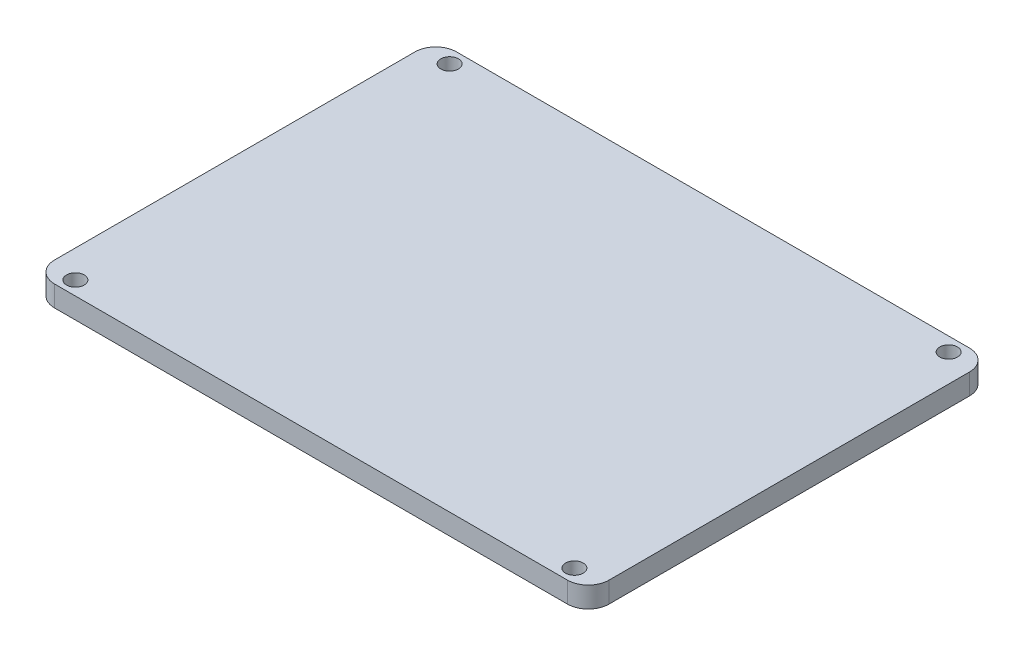
ISO-10303-21;
HEADER;
FILE_DESCRIPTION(('STEP AP214'),'2;1');
FILE_NAME('part.step','',(''),(''),'','','');
FILE_SCHEMA(('AUTOMOTIVE_DESIGN { 1 0 10303 214 1 1 1 1 }'));
ENDSEC;
DATA;
#1=APPLICATION_CONTEXT('core data for automotive mechanical design processes');
#2=APPLICATION_PROTOCOL_DEFINITION('international standard','automotive_design',2000,#1);
#3=PRODUCT_CONTEXT('',#1,'mechanical');
#4=PRODUCT('Part','Part','',(#3));
#5=PRODUCT_RELATED_PRODUCT_CATEGORY('part','',(#4));
#6=PRODUCT_DEFINITION_FORMATION('','',#4);
#7=PRODUCT_DEFINITION_CONTEXT('part definition',#1,'design');
#8=PRODUCT_DEFINITION('design','',#6,#7);
#9=PRODUCT_DEFINITION_SHAPE('','',#8);
#10=(LENGTH_UNIT() NAMED_UNIT(*) SI_UNIT(.MILLI.,.METRE.));
#11=(NAMED_UNIT(*) PLANE_ANGLE_UNIT() SI_UNIT($,.RADIAN.));
#12=(NAMED_UNIT(*) SI_UNIT($,.STERADIAN.) SOLID_ANGLE_UNIT());
#13=UNCERTAINTY_MEASURE_WITH_UNIT(LENGTH_MEASURE(1.E-05),#10,'distance_accuracy_value','');
#14=(GEOMETRIC_REPRESENTATION_CONTEXT(3) GLOBAL_UNCERTAINTY_ASSIGNED_CONTEXT((#13)) GLOBAL_UNIT_ASSIGNED_CONTEXT((#10,
#11,#12)) REPRESENTATION_CONTEXT('',''));
#15=CARTESIAN_POINT('',(0.,0.,0.));
#16=DIRECTION('',(0.,0.,1.));
#17=DIRECTION('',(1.,0.,0.));
#18=AXIS2_PLACEMENT_3D('',#15,#16,#17);
#19=CARTESIAN_POINT('',(40.,3.,29.));
#20=DIRECTION('',(-1.,0.,0.));
#21=DIRECTION('',(0.,0.,1.));
#22=AXIS2_PLACEMENT_3D('',#19,#20,#21);
#23=PLANE('',#22);
#24=DIRECTION('',(0.,0.,-1.));
#25=VECTOR('',#24,1.);
#26=CARTESIAN_POINT('',(40.,3.,29.));
#27=LINE('',#26,#25);
#28=CARTESIAN_POINT('',(40.,3.,26.));
#29=VERTEX_POINT('',#28);
#30=CARTESIAN_POINT('',(40.,3.,-26.));
#31=VERTEX_POINT('',#30);
#32=EDGE_CURVE('E121',#29,#31,#27,.T.);
#33=ORIENTED_EDGE('',*,*,#32,.F.);
#34=DIRECTION('',(0.,-1.,0.));
#35=VECTOR('',#34,1.);
#36=CARTESIAN_POINT('',(40.,3.,26.));
#37=LINE('',#36,#35);
#38=CARTESIAN_POINT('',(40.,0.,26.));
#39=VERTEX_POINT('',#38);
#40=EDGE_CURVE('E106',#29,#39,#37,.T.);
#41=ORIENTED_EDGE('',*,*,#40,.T.);
#42=DIRECTION('',(0.,0.,-1.));
#43=VECTOR('',#42,1.);
#44=CARTESIAN_POINT('',(40.,0.,29.));
#45=LINE('',#44,#43);
#46=CARTESIAN_POINT('',(40.,0.,-26.));
#47=VERTEX_POINT('',#46);
#48=EDGE_CURVE('E118',#39,#47,#45,.T.);
#49=ORIENTED_EDGE('',*,*,#48,.T.);
#50=DIRECTION('',(0.,-1.,0.));
#51=VECTOR('',#50,1.);
#52=CARTESIAN_POINT('',(40.,3.,-26.));
#53=LINE('',#52,#51);
#54=EDGE_CURVE('E123',#47,#31,#53,.F.);
#55=ORIENTED_EDGE('',*,*,#54,.T.);
#56=EDGE_LOOP('',(#33,#41,#49,#55));
#57=FACE_BOUND('',#56,.T.);
#58=ADVANCED_FACE('F35',(#57),#23,.F.);
#59=CARTESIAN_POINT('',(-40.,3.,-29.));
#60=DIRECTION('',(0.,0.,1.));
#61=DIRECTION('',(1.,0.,0.));
#62=AXIS2_PLACEMENT_3D('',#59,#60,#61);
#63=PLANE('',#62);
#64=DIRECTION('',(-1.,0.,0.));
#65=VECTOR('',#64,1.);
#66=CARTESIAN_POINT('',(-40.,3.,-29.));
#67=LINE('',#66,#65);
#68=CARTESIAN_POINT('',(37.,3.,-29.));
#69=VERTEX_POINT('',#68);
#70=CARTESIAN_POINT('',(-37.,3.,-29.));
#71=VERTEX_POINT('',#70);
#72=EDGE_CURVE('E165',#69,#71,#67,.T.);
#73=ORIENTED_EDGE('',*,*,#72,.F.);
#74=DIRECTION('',(0.,-1.,0.));
#75=VECTOR('',#74,1.);
#76=CARTESIAN_POINT('',(37.,3.,-29.));
#77=LINE('',#76,#75);
#78=CARTESIAN_POINT('',(37.,0.,-29.));
#79=VERTEX_POINT('',#78);
#80=EDGE_CURVE('E11',#69,#79,#77,.T.);
#81=ORIENTED_EDGE('',*,*,#80,.T.);
#82=DIRECTION('',(-1.,0.,0.));
#83=VECTOR('',#82,1.);
#84=CARTESIAN_POINT('',(-40.,0.,-29.));
#85=LINE('',#84,#83);
#86=CARTESIAN_POINT('',(-37.,0.,-29.));
#87=VERTEX_POINT('',#86);
#88=EDGE_CURVE('E128',#79,#87,#85,.T.);
#89=ORIENTED_EDGE('',*,*,#88,.T.);
#90=DIRECTION('',(0.,-1.,0.));
#91=VECTOR('',#90,1.);
#92=CARTESIAN_POINT('',(-37.,3.,-29.));
#93=LINE('',#92,#91);
#94=EDGE_CURVE('E43',#87,#71,#93,.F.);
#95=ORIENTED_EDGE('',*,*,#94,.T.);
#96=EDGE_LOOP('',(#73,#81,#89,#95));
#97=FACE_BOUND('',#96,.T.);
#98=ADVANCED_FACE('F164',(#97),#63,.F.);
#99=CARTESIAN_POINT('',(-40.,3.,29.));
#100=DIRECTION('',(1.,0.,0.));
#101=DIRECTION('',(0.,0.,-1.));
#102=AXIS2_PLACEMENT_3D('',#99,#100,#101);
#103=PLANE('',#102);
#104=DIRECTION('',(0.,0.,1.));
#105=VECTOR('',#104,1.);
#106=CARTESIAN_POINT('',(-40.,0.,29.));
#107=LINE('',#106,#105);
#108=CARTESIAN_POINT('',(-40.,0.,-26.));
#109=VERTEX_POINT('',#108);
#110=CARTESIAN_POINT('',(-40.,0.,26.));
#111=VERTEX_POINT('',#110);
#112=EDGE_CURVE('E132',#109,#111,#107,.T.);
#113=ORIENTED_EDGE('',*,*,#112,.T.);
#114=DIRECTION('',(0.,-1.,0.));
#115=VECTOR('',#114,1.);
#116=CARTESIAN_POINT('',(-40.,3.,26.));
#117=LINE('',#116,#115);
#118=CARTESIAN_POINT('',(-40.,3.,26.));
#119=VERTEX_POINT('',#118);
#120=EDGE_CURVE('E50',#111,#119,#117,.F.);
#121=ORIENTED_EDGE('',*,*,#120,.T.);
#122=DIRECTION('',(0.,0.,1.));
#123=VECTOR('',#122,1.);
#124=CARTESIAN_POINT('',(-40.,3.,29.));
#125=LINE('',#124,#123);
#126=CARTESIAN_POINT('',(-40.,3.,-26.));
#127=VERTEX_POINT('',#126);
#128=EDGE_CURVE('E171',#127,#119,#125,.T.);
#129=ORIENTED_EDGE('',*,*,#128,.F.);
#130=DIRECTION('',(0.,-1.,0.));
#131=VECTOR('',#130,1.);
#132=CARTESIAN_POINT('',(-40.,3.,-26.));
#133=LINE('',#132,#131);
#134=EDGE_CURVE('E158',#127,#109,#133,.T.);
#135=ORIENTED_EDGE('',*,*,#134,.T.);
#136=EDGE_LOOP('',(#113,#121,#129,#135));
#137=FACE_BOUND('',#136,.T.);
#138=ADVANCED_FACE('F175',(#137),#103,.F.);
#139=CARTESIAN_POINT('',(-40.,3.,29.));
#140=DIRECTION('',(0.,0.,-1.));
#141=DIRECTION('',(-1.,0.,0.));
#142=AXIS2_PLACEMENT_3D('',#139,#140,#141);
#143=PLANE('',#142);
#144=DIRECTION('',(1.,0.,0.));
#145=VECTOR('',#144,1.);
#146=CARTESIAN_POINT('',(-40.,0.,29.));
#147=LINE('',#146,#145);
#148=CARTESIAN_POINT('',(-37.,0.,29.));
#149=VERTEX_POINT('',#148);
#150=CARTESIAN_POINT('',(37.,0.,29.));
#151=VERTEX_POINT('',#150);
#152=EDGE_CURVE('E142',#149,#151,#147,.T.);
#153=ORIENTED_EDGE('',*,*,#152,.T.);
#154=DIRECTION('',(0.,-1.,0.));
#155=VECTOR('',#154,1.);
#156=CARTESIAN_POINT('',(37.,3.,29.));
#157=LINE('',#156,#155);
#158=CARTESIAN_POINT('',(37.,3.,29.));
#159=VERTEX_POINT('',#158);
#160=EDGE_CURVE('E107',#151,#159,#157,.F.);
#161=ORIENTED_EDGE('',*,*,#160,.T.);
#162=DIRECTION('',(1.,0.,0.));
#163=VECTOR('',#162,1.);
#164=CARTESIAN_POINT('',(-40.,3.,29.));
#165=LINE('',#164,#163);
#166=CARTESIAN_POINT('',(-37.,3.,29.));
#167=VERTEX_POINT('',#166);
#168=EDGE_CURVE('E138',#167,#159,#165,.T.);
#169=ORIENTED_EDGE('',*,*,#168,.F.);
#170=DIRECTION('',(0.,-1.,0.));
#171=VECTOR('',#170,1.);
#172=CARTESIAN_POINT('',(-37.,3.,29.));
#173=LINE('',#172,#171);
#174=EDGE_CURVE('E112',#167,#149,#173,.T.);
#175=ORIENTED_EDGE('',*,*,#174,.T.);
#176=EDGE_LOOP('',(#153,#161,#169,#175));
#177=FACE_BOUND('',#176,.T.);
#178=ADVANCED_FACE('F182',(#177),#143,.F.);
#179=CARTESIAN_POINT('',(0.,3.,0.));
#180=DIRECTION('',(0.,-1.,0.));
#181=DIRECTION('',(0.,0.,-1.));
#182=AXIS2_PLACEMENT_3D('',#179,#180,#181);
#183=PLANE('',#182);
#184=CARTESIAN_POINT('',(-36.,3.,27.));
#185=DIRECTION('',(0.,-1.,0.));
#186=DIRECTION('',(0.,0.,-1.));
#187=AXIS2_PLACEMENT_3D('',#184,#185,#186);
#188=CIRCLE('',#187,1.275);
#189=CARTESIAN_POINT('',(-36.,3.,25.725));
#190=VERTEX_POINT('',#189);
#191=EDGE_CURVE('E129',#190,#190,#188,.T.);
#192=ORIENTED_EDGE('',*,*,#191,.T.);
#193=EDGE_LOOP('',(#192));
#194=FACE_BOUND('',#193,.T.);
#195=CARTESIAN_POINT('',(-36.,3.,-27.));
#196=DIRECTION('',(0.,-1.,0.));
#197=DIRECTION('',(0.,0.,-1.));
#198=AXIS2_PLACEMENT_3D('',#195,#196,#197);
#199=CIRCLE('',#198,1.275);
#200=CARTESIAN_POINT('',(-36.,3.,-28.275));
#201=VERTEX_POINT('',#200);
#202=EDGE_CURVE('E135',#201,#201,#199,.T.);
#203=ORIENTED_EDGE('',*,*,#202,.T.);
#204=EDGE_LOOP('',(#203));
#205=FACE_BOUND('',#204,.T.);
#206=CARTESIAN_POINT('',(36.,3.,-27.));
#207=DIRECTION('',(0.,-1.,0.));
#208=DIRECTION('',(0.,0.,-1.));
#209=AXIS2_PLACEMENT_3D('',#206,#207,#208);
#210=CIRCLE('',#209,1.275);
#211=CARTESIAN_POINT('',(36.,3.,-28.275));
#212=VERTEX_POINT('',#211);
#213=EDGE_CURVE('E187',#212,#212,#210,.T.);
#214=ORIENTED_EDGE('',*,*,#213,.T.);
#215=EDGE_LOOP('',(#214));
#216=FACE_BOUND('',#215,.T.);
#217=CARTESIAN_POINT('',(36.,3.,27.));
#218=DIRECTION('',(0.,-1.,0.));
#219=DIRECTION('',(0.,0.,-1.));
#220=AXIS2_PLACEMENT_3D('',#217,#218,#219);
#221=CIRCLE('',#220,1.275);
#222=CARTESIAN_POINT('',(36.,3.,25.725));
#223=VERTEX_POINT('',#222);
#224=EDGE_CURVE('E190',#223,#223,#221,.T.);
#225=ORIENTED_EDGE('',*,*,#224,.T.);
#226=EDGE_LOOP('',(#225));
#227=FACE_BOUND('',#226,.T.);
#228=ORIENTED_EDGE('',*,*,#168,.T.);
#229=CARTESIAN_POINT('',(37.,3.,26.));
#230=DIRECTION('',(0.,-1.,0.));
#231=DIRECTION('',(0.,0.,-1.));
#232=AXIS2_PLACEMENT_3D('',#229,#230,#231);
#233=CIRCLE('',#232,3.);
#234=EDGE_CURVE('E156',#159,#29,#233,.F.);
#235=ORIENTED_EDGE('',*,*,#234,.T.);
#236=ORIENTED_EDGE('',*,*,#32,.T.);
#237=CARTESIAN_POINT('',(37.,3.,-26.));
#238=DIRECTION('',(0.,-1.,0.));
#239=DIRECTION('',(0.,0.,-1.));
#240=AXIS2_PLACEMENT_3D('',#237,#238,#239);
#241=CIRCLE('',#240,3.);
#242=EDGE_CURVE('E152',#31,#69,#241,.F.);
#243=ORIENTED_EDGE('',*,*,#242,.T.);
#244=ORIENTED_EDGE('',*,*,#72,.T.);
#245=CARTESIAN_POINT('',(-37.,3.,-26.));
#246=DIRECTION('',(0.,-1.,0.));
#247=DIRECTION('',(0.,0.,-1.));
#248=AXIS2_PLACEMENT_3D('',#245,#246,#247);
#249=CIRCLE('',#248,3.);
#250=EDGE_CURVE('E57',#71,#127,#249,.F.);
#251=ORIENTED_EDGE('',*,*,#250,.T.);
#252=ORIENTED_EDGE('',*,*,#128,.T.);
#253=CARTESIAN_POINT('',(-37.,3.,26.));
#254=DIRECTION('',(0.,-1.,0.));
#255=DIRECTION('',(0.,0.,-1.));
#256=AXIS2_PLACEMENT_3D('',#253,#254,#255);
#257=CIRCLE('',#256,3.);
#258=EDGE_CURVE('E154',#119,#167,#257,.F.);
#259=ORIENTED_EDGE('',*,*,#258,.T.);
#260=EDGE_LOOP('',(#228,#235,#236,#243,#244,#251,#252,#259));
#261=FACE_BOUND('',#260,.T.);
#262=ADVANCED_FACE('F169',(#194,#205,#216,#227,#261),#183,.F.);
#263=CARTESIAN_POINT('',(0.,0.,0.));
#264=DIRECTION('',(0.,-1.,0.));
#265=DIRECTION('',(0.,0.,-1.));
#266=AXIS2_PLACEMENT_3D('',#263,#264,#265);
#267=PLANE('',#266);
#268=CARTESIAN_POINT('',(-36.,0.,27.));
#269=DIRECTION('',(0.,1.,0.));
#270=DIRECTION('',(0.,0.,1.));
#271=AXIS2_PLACEMENT_3D('',#268,#269,#270);
#272=CIRCLE('',#271,1.275);
#273=CARTESIAN_POINT('',(-36.,0.,28.275));
#274=VERTEX_POINT('',#273);
#275=EDGE_CURVE('E197',#274,#274,#272,.T.);
#276=ORIENTED_EDGE('',*,*,#275,.T.);
#277=EDGE_LOOP('',(#276));
#278=FACE_BOUND('',#277,.T.);
#279=CARTESIAN_POINT('',(-36.,0.,-27.));
#280=DIRECTION('',(0.,1.,0.));
#281=DIRECTION('',(0.,0.,1.));
#282=AXIS2_PLACEMENT_3D('',#279,#280,#281);
#283=CIRCLE('',#282,1.275);
#284=CARTESIAN_POINT('',(-36.,0.,-25.725));
#285=VERTEX_POINT('',#284);
#286=EDGE_CURVE('E200',#285,#285,#283,.T.);
#287=ORIENTED_EDGE('',*,*,#286,.T.);
#288=EDGE_LOOP('',(#287));
#289=FACE_BOUND('',#288,.T.);
#290=CARTESIAN_POINT('',(36.,0.,-27.));
#291=DIRECTION('',(0.,1.,0.));
#292=DIRECTION('',(0.,0.,1.));
#293=AXIS2_PLACEMENT_3D('',#290,#291,#292);
#294=CIRCLE('',#293,1.275);
#295=CARTESIAN_POINT('',(36.,0.,-25.725));
#296=VERTEX_POINT('',#295);
#297=EDGE_CURVE('E196',#296,#296,#294,.T.);
#298=ORIENTED_EDGE('',*,*,#297,.T.);
#299=EDGE_LOOP('',(#298));
#300=FACE_BOUND('',#299,.T.);
#301=CARTESIAN_POINT('',(36.,0.,27.));
#302=DIRECTION('',(0.,1.,0.));
#303=DIRECTION('',(0.,0.,1.));
#304=AXIS2_PLACEMENT_3D('',#301,#302,#303);
#305=CIRCLE('',#304,1.275);
#306=CARTESIAN_POINT('',(36.,0.,28.275));
#307=VERTEX_POINT('',#306);
#308=EDGE_CURVE('E193',#307,#307,#305,.T.);
#309=ORIENTED_EDGE('',*,*,#308,.T.);
#310=EDGE_LOOP('',(#309));
#311=FACE_BOUND('',#310,.T.);
#312=ORIENTED_EDGE('',*,*,#48,.F.);
#313=CARTESIAN_POINT('',(37.,0.,26.));
#314=DIRECTION('',(0.,-1.,0.));
#315=DIRECTION('',(0.,0.,-1.));
#316=AXIS2_PLACEMENT_3D('',#313,#314,#315);
#317=CIRCLE('',#316,3.);
#318=EDGE_CURVE('E102',#39,#151,#317,.T.);
#319=ORIENTED_EDGE('',*,*,#318,.T.);
#320=ORIENTED_EDGE('',*,*,#152,.F.);
#321=CARTESIAN_POINT('',(-37.,0.,26.));
#322=DIRECTION('',(0.,-1.,0.));
#323=DIRECTION('',(0.,0.,-1.));
#324=AXIS2_PLACEMENT_3D('',#321,#322,#323);
#325=CIRCLE('',#324,3.);
#326=EDGE_CURVE('E113',#149,#111,#325,.T.);
#327=ORIENTED_EDGE('',*,*,#326,.T.);
#328=ORIENTED_EDGE('',*,*,#112,.F.);
#329=CARTESIAN_POINT('',(-37.,0.,-26.));
#330=DIRECTION('',(0.,-1.,0.));
#331=DIRECTION('',(0.,0.,-1.));
#332=AXIS2_PLACEMENT_3D('',#329,#330,#331);
#333=CIRCLE('',#332,3.);
#334=EDGE_CURVE('E122',#109,#87,#333,.T.);
#335=ORIENTED_EDGE('',*,*,#334,.T.);
#336=ORIENTED_EDGE('',*,*,#88,.F.);
#337=CARTESIAN_POINT('',(37.,0.,-26.));
#338=DIRECTION('',(0.,-1.,0.));
#339=DIRECTION('',(0.,0.,-1.));
#340=AXIS2_PLACEMENT_3D('',#337,#338,#339);
#341=CIRCLE('',#340,3.);
#342=EDGE_CURVE('E127',#79,#47,#341,.T.);
#343=ORIENTED_EDGE('',*,*,#342,.T.);
#344=EDGE_LOOP('',(#312,#319,#320,#327,#328,#335,#336,#343));
#345=FACE_BOUND('',#344,.T.);
#346=ADVANCED_FACE('F125',(#278,#289,#300,#311,#345),#267,.T.);
#347=CARTESIAN_POINT('',(36.,0.,27.));
#348=DIRECTION('',(0.,1.,0.));
#349=DIRECTION('',(0.,0.,1.));
#350=AXIS2_PLACEMENT_3D('',#347,#348,#349);
#351=CYLINDRICAL_SURFACE('',#350,1.275);
#352=ORIENTED_EDGE('',*,*,#308,.F.);
#353=EDGE_LOOP('',(#352));
#354=FACE_BOUND('',#353,.T.);
#355=ORIENTED_EDGE('',*,*,#224,.F.);
#356=EDGE_LOOP('',(#355));
#357=FACE_BOUND('',#356,.T.);
#358=ADVANCED_FACE('F212',(#354,#357),#351,.F.);
#359=CARTESIAN_POINT('',(36.,0.,-27.));
#360=DIRECTION('',(0.,1.,0.));
#361=DIRECTION('',(0.,0.,1.));
#362=AXIS2_PLACEMENT_3D('',#359,#360,#361);
#363=CYLINDRICAL_SURFACE('',#362,1.275);
#364=ORIENTED_EDGE('',*,*,#297,.F.);
#365=EDGE_LOOP('',(#364));
#366=FACE_BOUND('',#365,.T.);
#367=ORIENTED_EDGE('',*,*,#213,.F.);
#368=EDGE_LOOP('',(#367));
#369=FACE_BOUND('',#368,.T.);
#370=ADVANCED_FACE('F208',(#366,#369),#363,.F.);
#371=CARTESIAN_POINT('',(-36.,0.,-27.));
#372=DIRECTION('',(0.,1.,0.));
#373=DIRECTION('',(0.,0.,1.));
#374=AXIS2_PLACEMENT_3D('',#371,#372,#373);
#375=CYLINDRICAL_SURFACE('',#374,1.275);
#376=ORIENTED_EDGE('',*,*,#286,.F.);
#377=EDGE_LOOP('',(#376));
#378=FACE_BOUND('',#377,.T.);
#379=ORIENTED_EDGE('',*,*,#202,.F.);
#380=EDGE_LOOP('',(#379));
#381=FACE_BOUND('',#380,.T.);
#382=ADVANCED_FACE('F211',(#378,#381),#375,.F.);
#383=CARTESIAN_POINT('',(-36.,0.,27.));
#384=DIRECTION('',(0.,1.,0.));
#385=DIRECTION('',(0.,0.,1.));
#386=AXIS2_PLACEMENT_3D('',#383,#384,#385);
#387=CYLINDRICAL_SURFACE('',#386,1.275);
#388=ORIENTED_EDGE('',*,*,#275,.F.);
#389=EDGE_LOOP('',(#388));
#390=FACE_BOUND('',#389,.T.);
#391=ORIENTED_EDGE('',*,*,#191,.F.);
#392=EDGE_LOOP('',(#391));
#393=FACE_BOUND('',#392,.T.);
#394=ADVANCED_FACE('F242',(#390,#393),#387,.F.);
#395=CARTESIAN_POINT('',(37.,3.,26.));
#396=DIRECTION('',(0.,-1.,0.));
#397=DIRECTION('',(0.,0.,-1.));
#398=AXIS2_PLACEMENT_3D('',#395,#396,#397);
#399=CYLINDRICAL_SURFACE('',#398,3.);
#400=ORIENTED_EDGE('',*,*,#234,.F.);
#401=ORIENTED_EDGE('',*,*,#160,.F.);
#402=ORIENTED_EDGE('',*,*,#318,.F.);
#403=ORIENTED_EDGE('',*,*,#40,.F.);
#404=EDGE_LOOP('',(#400,#401,#402,#403));
#405=FACE_BOUND('',#404,.T.);
#406=ADVANCED_FACE('F105',(#405),#399,.T.);
#407=CARTESIAN_POINT('',(-37.,3.,26.));
#408=DIRECTION('',(0.,-1.,0.));
#409=DIRECTION('',(0.,0.,-1.));
#410=AXIS2_PLACEMENT_3D('',#407,#408,#409);
#411=CYLINDRICAL_SURFACE('',#410,3.);
#412=ORIENTED_EDGE('',*,*,#258,.F.);
#413=ORIENTED_EDGE('',*,*,#120,.F.);
#414=ORIENTED_EDGE('',*,*,#326,.F.);
#415=ORIENTED_EDGE('',*,*,#174,.F.);
#416=EDGE_LOOP('',(#412,#413,#414,#415));
#417=FACE_BOUND('',#416,.T.);
#418=ADVANCED_FACE('F179',(#417),#411,.T.);
#419=CARTESIAN_POINT('',(37.,3.,-26.));
#420=DIRECTION('',(0.,-1.,0.));
#421=DIRECTION('',(0.,0.,-1.));
#422=AXIS2_PLACEMENT_3D('',#419,#420,#421);
#423=CYLINDRICAL_SURFACE('',#422,3.);
#424=ORIENTED_EDGE('',*,*,#242,.F.);
#425=ORIENTED_EDGE('',*,*,#54,.F.);
#426=ORIENTED_EDGE('',*,*,#342,.F.);
#427=ORIENTED_EDGE('',*,*,#80,.F.);
#428=EDGE_LOOP('',(#424,#425,#426,#427));
#429=FACE_BOUND('',#428,.T.);
#430=ADVANCED_FACE('F244',(#429),#423,.T.);
#431=CARTESIAN_POINT('',(-37.,3.,-26.));
#432=DIRECTION('',(0.,-1.,0.));
#433=DIRECTION('',(0.,0.,-1.));
#434=AXIS2_PLACEMENT_3D('',#431,#432,#433);
#435=CYLINDRICAL_SURFACE('',#434,3.);
#436=ORIENTED_EDGE('',*,*,#250,.F.);
#437=ORIENTED_EDGE('',*,*,#94,.F.);
#438=ORIENTED_EDGE('',*,*,#334,.F.);
#439=ORIENTED_EDGE('',*,*,#134,.F.);
#440=EDGE_LOOP('',(#436,#437,#438,#439));
#441=FACE_BOUND('',#440,.T.);
#442=ADVANCED_FACE('F37',(#441),#435,.T.);
#443=CLOSED_SHELL('',(#58,#98,#138,#178,#262,#346,#358,#370,#382,#394,#406,#418,#430,#442));
#444=MANIFOLD_SOLID_BREP('B2',#443);
#445=ADVANCED_BREP_SHAPE_REPRESENTATION('',(#18,#444),#14);
#446=SHAPE_DEFINITION_REPRESENTATION(#9,#445);
ENDSEC;
END-ISO-10303-21;
